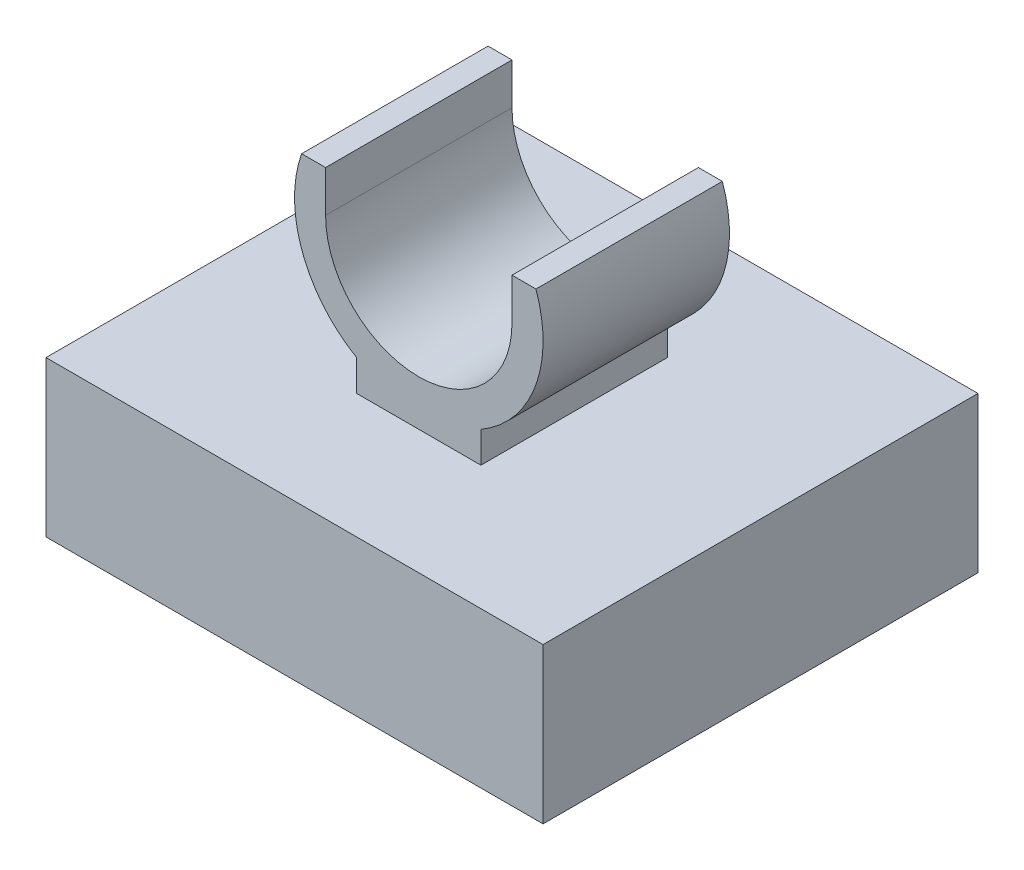
ISO-10303-21;
HEADER;
FILE_DESCRIPTION(('STEP AP214'),'2;1');
FILE_NAME('part.step','',(''),(''),'','','');
FILE_SCHEMA(('AUTOMOTIVE_DESIGN { 1 0 10303 214 1 1 1 1 }'));
ENDSEC;
DATA;
#1=APPLICATION_CONTEXT('core data for automotive mechanical design processes');
#2=APPLICATION_PROTOCOL_DEFINITION('international standard','automotive_design',2000,#1);
#3=PRODUCT_CONTEXT('',#1,'mechanical');
#4=PRODUCT('Part','Part','',(#3));
#5=PRODUCT_RELATED_PRODUCT_CATEGORY('part','',(#4));
#6=PRODUCT_DEFINITION_FORMATION('','',#4);
#7=PRODUCT_DEFINITION_CONTEXT('part definition',#1,'design');
#8=PRODUCT_DEFINITION('design','',#6,#7);
#9=PRODUCT_DEFINITION_SHAPE('','',#8);
#10=(LENGTH_UNIT() NAMED_UNIT(*) SI_UNIT(.MILLI.,.METRE.));
#11=(NAMED_UNIT(*) PLANE_ANGLE_UNIT() SI_UNIT($,.RADIAN.));
#12=(NAMED_UNIT(*) SI_UNIT($,.STERADIAN.) SOLID_ANGLE_UNIT());
#13=UNCERTAINTY_MEASURE_WITH_UNIT(LENGTH_MEASURE(1.E-05),#10,'distance_accuracy_value','');
#14=(GEOMETRIC_REPRESENTATION_CONTEXT(3) GLOBAL_UNCERTAINTY_ASSIGNED_CONTEXT((#13)) GLOBAL_UNIT_ASSIGNED_CONTEXT((#10,
#11,#12)) REPRESENTATION_CONTEXT('',''));
#15=CARTESIAN_POINT('',(0.,0.,0.));
#16=DIRECTION('',(0.,0.,1.));
#17=DIRECTION('',(1.,0.,0.));
#18=AXIS2_PLACEMENT_3D('',#15,#16,#17);
#19=CARTESIAN_POINT('',(-5.08,-3.175,4.445));
#20=DIRECTION('',(1.,0.,0.));
#21=DIRECTION('',(0.,0.,-1.));
#22=AXIS2_PLACEMENT_3D('',#19,#20,#21);
#23=PLANE('',#22);
#24=DIRECTION('',(0.,0.,-1.));
#25=VECTOR('',#24,1.);
#26=CARTESIAN_POINT('',(-5.08,-3.175,4.445));
#27=LINE('',#26,#25);
#28=CARTESIAN_POINT('',(-5.08,-3.175,4.445));
#29=VERTEX_POINT('',#28);
#30=CARTESIAN_POINT('',(-5.08,-3.175,-4.445));
#31=VERTEX_POINT('',#30);
#32=EDGE_CURVE('E12',#29,#31,#27,.T.);
#33=ORIENTED_EDGE('',*,*,#32,.F.);
#34=DIRECTION('',(0.,-1.,0.));
#35=VECTOR('',#34,1.);
#36=CARTESIAN_POINT('',(-5.08,-3.175,4.445));
#37=LINE('',#36,#35);
#38=CARTESIAN_POINT('',(-5.08,0.,4.445));
#39=VERTEX_POINT('',#38);
#40=EDGE_CURVE('E269',#39,#29,#37,.T.);
#41=ORIENTED_EDGE('',*,*,#40,.F.);
#42=DIRECTION('',(0.,0.,-1.));
#43=VECTOR('',#42,1.);
#44=CARTESIAN_POINT('',(-5.08,0.,4.445));
#45=LINE('',#44,#43);
#46=CARTESIAN_POINT('',(-5.08,0.,-4.445));
#47=VERTEX_POINT('',#46);
#48=EDGE_CURVE('E278',#39,#47,#45,.T.);
#49=ORIENTED_EDGE('',*,*,#48,.T.);
#50=DIRECTION('',(0.,-1.,0.));
#51=VECTOR('',#50,1.);
#52=CARTESIAN_POINT('',(-5.08,-3.175,-4.445));
#53=LINE('',#52,#51);
#54=EDGE_CURVE('E268',#47,#31,#53,.T.);
#55=ORIENTED_EDGE('',*,*,#54,.T.);
#56=EDGE_LOOP('',(#33,#41,#49,#55));
#57=FACE_BOUND('',#56,.T.);
#58=ADVANCED_FACE('F35',(#57),#23,.F.);
#59=CARTESIAN_POINT('',(5.08,-3.175,4.445));
#60=DIRECTION('',(0.,1.,0.));
#61=DIRECTION('',(-1.,0.,0.));
#62=AXIS2_PLACEMENT_3D('',#59,#60,#61);
#63=PLANE('',#62);
#64=DIRECTION('',(0.,0.,-1.));
#65=VECTOR('',#64,1.);
#66=CARTESIAN_POINT('',(-2.54,-3.175,2.54));
#67=LINE('',#66,#65);
#68=CARTESIAN_POINT('',(-2.54,-3.175,2.54));
#69=VERTEX_POINT('',#68);
#70=CARTESIAN_POINT('',(-2.54,-3.175,-2.54));
#71=VERTEX_POINT('',#70);
#72=EDGE_CURVE('E189',#69,#71,#67,.T.);
#73=ORIENTED_EDGE('',*,*,#72,.F.);
#74=DIRECTION('',(-1.,0.,0.));
#75=VECTOR('',#74,1.);
#76=CARTESIAN_POINT('',(2.54,-3.175,2.54));
#77=LINE('',#76,#75);
#78=CARTESIAN_POINT('',(2.54,-3.175,2.54));
#79=VERTEX_POINT('',#78);
#80=EDGE_CURVE('E49',#79,#69,#77,.T.);
#81=ORIENTED_EDGE('',*,*,#80,.F.);
#82=DIRECTION('',(0.,0.,1.));
#83=VECTOR('',#82,1.);
#84=CARTESIAN_POINT('',(2.54,-3.175,-2.54));
#85=LINE('',#84,#83);
#86=CARTESIAN_POINT('',(2.54,-3.175,-2.54));
#87=VERTEX_POINT('',#86);
#88=EDGE_CURVE('E180',#87,#79,#85,.T.);
#89=ORIENTED_EDGE('',*,*,#88,.F.);
#90=DIRECTION('',(1.,0.,0.));
#91=VECTOR('',#90,1.);
#92=CARTESIAN_POINT('',(-2.54,-3.175,-2.54));
#93=LINE('',#92,#91);
#94=EDGE_CURVE('E183',#71,#87,#93,.T.);
#95=ORIENTED_EDGE('',*,*,#94,.F.);
#96=EDGE_LOOP('',(#73,#81,#89,#95));
#97=FACE_BOUND('',#96,.T.);
#98=DIRECTION('',(1.,0.,0.));
#99=VECTOR('',#98,1.);
#100=CARTESIAN_POINT('',(5.08,-3.175,-4.445));
#101=LINE('',#100,#99);
#102=CARTESIAN_POINT('',(5.08,-3.175,-4.445));
#103=VERTEX_POINT('',#102);
#104=EDGE_CURVE('E280',#31,#103,#101,.T.);
#105=ORIENTED_EDGE('',*,*,#104,.T.);
#106=DIRECTION('',(0.,0.,-1.));
#107=VECTOR('',#106,1.);
#108=CARTESIAN_POINT('',(5.08,-3.175,4.445));
#109=LINE('',#108,#107);
#110=CARTESIAN_POINT('',(5.08,-3.175,4.445));
#111=VERTEX_POINT('',#110);
#112=EDGE_CURVE('E42',#111,#103,#109,.T.);
#113=ORIENTED_EDGE('',*,*,#112,.F.);
#114=DIRECTION('',(1.,0.,0.));
#115=VECTOR('',#114,1.);
#116=CARTESIAN_POINT('',(5.08,-3.175,4.445));
#117=LINE('',#116,#115);
#118=EDGE_CURVE('E271',#29,#111,#117,.T.);
#119=ORIENTED_EDGE('',*,*,#118,.F.);
#120=ORIENTED_EDGE('',*,*,#32,.T.);
#121=EDGE_LOOP('',(#105,#113,#119,#120));
#122=FACE_BOUND('',#121,.T.);
#123=ADVANCED_FACE('F312',(#97,#122),#63,.F.);
#124=CARTESIAN_POINT('',(5.08,0.,4.445));
#125=DIRECTION('',(-1.,0.,0.));
#126=DIRECTION('',(0.,0.,1.));
#127=AXIS2_PLACEMENT_3D('',#124,#125,#126);
#128=PLANE('',#127);
#129=DIRECTION('',(0.,1.,0.));
#130=VECTOR('',#129,1.);
#131=CARTESIAN_POINT('',(5.08,0.,-4.445));
#132=LINE('',#131,#130);
#133=CARTESIAN_POINT('',(5.08,0.,-4.445));
#134=VERTEX_POINT('',#133);
#135=EDGE_CURVE('E282',#103,#134,#132,.T.);
#136=ORIENTED_EDGE('',*,*,#135,.T.);
#137=DIRECTION('',(0.,0.,-1.));
#138=VECTOR('',#137,1.);
#139=CARTESIAN_POINT('',(5.08,0.,4.445));
#140=LINE('',#139,#138);
#141=CARTESIAN_POINT('',(5.08,0.,4.445));
#142=VERTEX_POINT('',#141);
#143=EDGE_CURVE('E287',#142,#134,#140,.T.);
#144=ORIENTED_EDGE('',*,*,#143,.F.);
#145=DIRECTION('',(0.,1.,0.));
#146=VECTOR('',#145,1.);
#147=CARTESIAN_POINT('',(5.08,0.,4.445));
#148=LINE('',#147,#146);
#149=EDGE_CURVE('E274',#111,#142,#148,.T.);
#150=ORIENTED_EDGE('',*,*,#149,.F.);
#151=ORIENTED_EDGE('',*,*,#112,.T.);
#152=EDGE_LOOP('',(#136,#144,#150,#151));
#153=FACE_BOUND('',#152,.T.);
#154=ADVANCED_FACE('F294',(#153),#128,.F.);
#155=CARTESIAN_POINT('',(-5.08,0.,4.445));
#156=DIRECTION('',(0.,-1.,0.));
#157=DIRECTION('',(0.,0.,-1.));
#158=AXIS2_PLACEMENT_3D('',#155,#156,#157);
#159=PLANE('',#158);
#160=DIRECTION('',(0.,0.,-1.));
#161=VECTOR('',#160,1.);
#162=CARTESIAN_POINT('',(-1.27,0.,1.905));
#163=LINE('',#162,#161);
#164=CARTESIAN_POINT('',(-1.27,0.,1.905));
#165=VERTEX_POINT('',#164);
#166=CARTESIAN_POINT('',(-1.27,0.,-1.905));
#167=VERTEX_POINT('',#166);
#168=EDGE_CURVE('E262',#165,#167,#163,.T.);
#169=ORIENTED_EDGE('',*,*,#168,.T.);
#170=DIRECTION('',(1.,0.,0.));
#171=VECTOR('',#170,1.);
#172=CARTESIAN_POINT('',(-1.27,0.,-1.905));
#173=LINE('',#172,#171);
#174=CARTESIAN_POINT('',(1.27,0.,-1.905));
#175=VERTEX_POINT('',#174);
#176=EDGE_CURVE('E57',#167,#175,#173,.T.);
#177=ORIENTED_EDGE('',*,*,#176,.T.);
#178=DIRECTION('',(0.,0.,-1.));
#179=VECTOR('',#178,1.);
#180=CARTESIAN_POINT('',(1.27,0.,1.905));
#181=LINE('',#180,#179);
#182=CARTESIAN_POINT('',(1.27,0.,1.905));
#183=VERTEX_POINT('',#182);
#184=EDGE_CURVE('E260',#183,#175,#181,.T.);
#185=ORIENTED_EDGE('',*,*,#184,.F.);
#186=DIRECTION('',(1.,0.,0.));
#187=VECTOR('',#186,1.);
#188=CARTESIAN_POINT('',(-1.27,0.,1.905));
#189=LINE('',#188,#187);
#190=EDGE_CURVE('E205',#165,#183,#189,.T.);
#191=ORIENTED_EDGE('',*,*,#190,.F.);
#192=EDGE_LOOP('',(#169,#177,#185,#191));
#193=FACE_BOUND('',#192,.T.);
#194=DIRECTION('',(-1.,0.,0.));
#195=VECTOR('',#194,1.);
#196=CARTESIAN_POINT('',(-5.08,0.,-4.445));
#197=LINE('',#196,#195);
#198=EDGE_CURVE('E272',#134,#47,#197,.T.);
#199=ORIENTED_EDGE('',*,*,#198,.T.);
#200=ORIENTED_EDGE('',*,*,#48,.F.);
#201=DIRECTION('',(-1.,0.,0.));
#202=VECTOR('',#201,1.);
#203=CARTESIAN_POINT('',(-5.08,0.,4.445));
#204=LINE('',#203,#202);
#205=EDGE_CURVE('E276',#142,#39,#204,.T.);
#206=ORIENTED_EDGE('',*,*,#205,.F.);
#207=ORIENTED_EDGE('',*,*,#143,.T.);
#208=EDGE_LOOP('',(#199,#200,#206,#207));
#209=FACE_BOUND('',#208,.T.);
#210=ADVANCED_FACE('F305',(#193,#209),#159,.F.);
#211=CARTESIAN_POINT('',(0.,0.,4.445));
#212=DIRECTION('',(0.,0.,-1.));
#213=DIRECTION('',(-1.,0.,0.));
#214=AXIS2_PLACEMENT_3D('',#211,#212,#213);
#215=PLANE('',#214);
#216=ORIENTED_EDGE('',*,*,#149,.T.);
#217=ORIENTED_EDGE('',*,*,#205,.T.);
#218=ORIENTED_EDGE('',*,*,#40,.T.);
#219=ORIENTED_EDGE('',*,*,#118,.T.);
#220=EDGE_LOOP('',(#216,#217,#218,#219));
#221=FACE_BOUND('',#220,.T.);
#222=ADVANCED_FACE('F311',(#221),#215,.F.);
#223=CARTESIAN_POINT('',(0.,0.,-4.445));
#224=DIRECTION('',(0.,0.,-1.));
#225=DIRECTION('',(-1.,0.,0.));
#226=AXIS2_PLACEMENT_3D('',#223,#224,#225);
#227=PLANE('',#226);
#228=ORIENTED_EDGE('',*,*,#104,.F.);
#229=ORIENTED_EDGE('',*,*,#54,.F.);
#230=ORIENTED_EDGE('',*,*,#198,.F.);
#231=ORIENTED_EDGE('',*,*,#135,.F.);
#232=EDGE_LOOP('',(#228,#229,#230,#231));
#233=FACE_BOUND('',#232,.T.);
#234=ADVANCED_FACE('F301',(#233),#227,.T.);
#235=CARTESIAN_POINT('',(0.,2.83470452561247,1.905));
#236=DIRECTION('',(0.,0.,-1.));
#237=DIRECTION('',(-1.,0.,0.));
#238=AXIS2_PLACEMENT_3D('',#235,#236,#237);
#239=CYLINDRICAL_SURFACE('',#238,2.54);
#240=CARTESIAN_POINT('',(0.,2.83470452561247,-1.905));
#241=DIRECTION('',(0.,0.,1.));
#242=DIRECTION('',(1.,0.,0.));
#243=AXIS2_PLACEMENT_3D('',#240,#241,#242);
#244=CIRCLE('',#243,2.54);
#245=CARTESIAN_POINT('',(-2.39473496561844,3.68137119227914,-1.905));
#246=VERTEX_POINT('',#245);
#247=CARTESIAN_POINT('',(-1.27,0.635,-1.905));
#248=VERTEX_POINT('',#247);
#249=EDGE_CURVE('E195',#246,#248,#244,.T.);
#250=ORIENTED_EDGE('',*,*,#249,.T.);
#251=DIRECTION('',(0.,0.,-1.));
#252=VECTOR('',#251,1.);
#253=CARTESIAN_POINT('',(-1.27,0.635,1.905));
#254=LINE('',#253,#252);
#255=CARTESIAN_POINT('',(-1.27,0.635,1.905));
#256=VERTEX_POINT('',#255);
#257=EDGE_CURVE('E265',#256,#248,#254,.T.);
#258=ORIENTED_EDGE('',*,*,#257,.F.);
#259=CARTESIAN_POINT('',(0.,2.83470452561247,1.905));
#260=DIRECTION('',(0.,0.,1.));
#261=DIRECTION('',(1.,0.,0.));
#262=AXIS2_PLACEMENT_3D('',#259,#260,#261);
#263=CIRCLE('',#262,2.54);
#264=CARTESIAN_POINT('',(-2.39473496561844,3.68137119227914,1.905));
#265=VERTEX_POINT('',#264);
#266=EDGE_CURVE('E199',#265,#256,#263,.T.);
#267=ORIENTED_EDGE('',*,*,#266,.F.);
#268=DIRECTION('',(0.,0.,-1.));
#269=VECTOR('',#268,1.);
#270=CARTESIAN_POINT('',(-2.39473496561844,3.68137119227914,1.905));
#271=LINE('',#270,#269);
#272=EDGE_CURVE('E221',#265,#246,#271,.T.);
#273=ORIENTED_EDGE('',*,*,#272,.T.);
#274=EDGE_LOOP('',(#250,#258,#267,#273));
#275=FACE_BOUND('',#274,.T.);
#276=ADVANCED_FACE('F326',(#275),#239,.T.);
#277=CARTESIAN_POINT('',(-1.27,0.635,1.905));
#278=DIRECTION('',(1.,0.,0.));
#279=DIRECTION('',(0.,1.,0.));
#280=AXIS2_PLACEMENT_3D('',#277,#278,#279);
#281=PLANE('',#280);
#282=DIRECTION('',(0.,-1.,0.));
#283=VECTOR('',#282,1.);
#284=CARTESIAN_POINT('',(-1.27,0.635,-1.905));
#285=LINE('',#284,#283);
#286=EDGE_CURVE('E224',#248,#167,#285,.T.);
#287=ORIENTED_EDGE('',*,*,#286,.T.);
#288=ORIENTED_EDGE('',*,*,#168,.F.);
#289=DIRECTION('',(0.,-1.,0.));
#290=VECTOR('',#289,1.);
#291=CARTESIAN_POINT('',(-1.27,0.635,1.905));
#292=LINE('',#291,#290);
#293=EDGE_CURVE('E202',#256,#165,#292,.T.);
#294=ORIENTED_EDGE('',*,*,#293,.F.);
#295=ORIENTED_EDGE('',*,*,#257,.T.);
#296=EDGE_LOOP('',(#287,#288,#294,#295));
#297=FACE_BOUND('',#296,.T.);
#298=ADVANCED_FACE('F331',(#297),#281,.F.);
#299=CARTESIAN_POINT('',(1.27,0.635,1.905));
#300=DIRECTION('',(-1.,0.,0.));
#301=DIRECTION('',(0.,-1.,0.));
#302=AXIS2_PLACEMENT_3D('',#299,#300,#301);
#303=PLANE('',#302);
#304=DIRECTION('',(0.,1.,0.));
#305=VECTOR('',#304,1.);
#306=CARTESIAN_POINT('',(1.27,0.635,-1.905));
#307=LINE('',#306,#305);
#308=CARTESIAN_POINT('',(1.27,0.635,-1.905));
#309=VERTEX_POINT('',#308);
#310=EDGE_CURVE('E227',#175,#309,#307,.T.);
#311=ORIENTED_EDGE('',*,*,#310,.T.);
#312=DIRECTION('',(0.,0.,-1.));
#313=VECTOR('',#312,1.);
#314=CARTESIAN_POINT('',(1.27,0.635,1.905));
#315=LINE('',#314,#313);
#316=CARTESIAN_POINT('',(1.27,0.635,1.905));
#317=VERTEX_POINT('',#316);
#318=EDGE_CURVE('E257',#317,#309,#315,.T.);
#319=ORIENTED_EDGE('',*,*,#318,.F.);
#320=DIRECTION('',(0.,1.,0.));
#321=VECTOR('',#320,1.);
#322=CARTESIAN_POINT('',(1.27,0.635,1.905));
#323=LINE('',#322,#321);
#324=EDGE_CURVE('E207',#183,#317,#323,.T.);
#325=ORIENTED_EDGE('',*,*,#324,.F.);
#326=ORIENTED_EDGE('',*,*,#184,.T.);
#327=EDGE_LOOP('',(#311,#319,#325,#326));
#328=FACE_BOUND('',#327,.T.);
#329=ADVANCED_FACE('F335',(#328),#303,.F.);
#330=CARTESIAN_POINT('',(0.,2.83470452561247,1.905));
#331=DIRECTION('',(0.,0.,-1.));
#332=DIRECTION('',(-1.,0.,0.));
#333=AXIS2_PLACEMENT_3D('',#330,#331,#332);
#334=CYLINDRICAL_SURFACE('',#333,2.54);
#335=CARTESIAN_POINT('',(0.,2.83470452561247,-1.905));
#336=DIRECTION('',(0.,0.,1.));
#337=DIRECTION('',(1.,0.,0.));
#338=AXIS2_PLACEMENT_3D('',#335,#336,#337);
#339=CIRCLE('',#338,2.54);
#340=CARTESIAN_POINT('',(2.39473496561844,3.68137119227914,-1.905));
#341=VERTEX_POINT('',#340);
#342=EDGE_CURVE('E229',#309,#341,#339,.T.);
#343=ORIENTED_EDGE('',*,*,#342,.T.);
#344=DIRECTION('',(0.,0.,-1.));
#345=VECTOR('',#344,1.);
#346=CARTESIAN_POINT('',(2.39473496561844,3.68137119227914,1.905));
#347=LINE('',#346,#345);
#348=CARTESIAN_POINT('',(2.39473496561844,3.68137119227914,1.905));
#349=VERTEX_POINT('',#348);
#350=EDGE_CURVE('E254',#349,#341,#347,.T.);
#351=ORIENTED_EDGE('',*,*,#350,.F.);
#352=CARTESIAN_POINT('',(0.,2.83470452561247,1.905));
#353=DIRECTION('',(0.,0.,1.));
#354=DIRECTION('',(1.,0.,0.));
#355=AXIS2_PLACEMENT_3D('',#352,#353,#354);
#356=CIRCLE('',#355,2.54);
#357=EDGE_CURVE('E209',#317,#349,#356,.T.);
#358=ORIENTED_EDGE('',*,*,#357,.F.);
#359=ORIENTED_EDGE('',*,*,#318,.T.);
#360=EDGE_LOOP('',(#343,#351,#358,#359));
#361=FACE_BOUND('',#360,.T.);
#362=ADVANCED_FACE('F339',(#361),#334,.T.);
#363=CARTESIAN_POINT('',(1.905,3.68137119227914,1.905));
#364=DIRECTION('',(0.,-1.,0.));
#365=DIRECTION('',(0.,0.,-1.));
#366=AXIS2_PLACEMENT_3D('',#363,#364,#365);
#367=PLANE('',#366);
#368=DIRECTION('',(-1.,0.,0.));
#369=VECTOR('',#368,1.);
#370=CARTESIAN_POINT('',(1.905,3.68137119227914,-1.905));
#371=LINE('',#370,#369);
#372=CARTESIAN_POINT('',(1.905,3.68137119227914,-1.905));
#373=VERTEX_POINT('',#372);
#374=EDGE_CURVE('E231',#341,#373,#371,.T.);
#375=ORIENTED_EDGE('',*,*,#374,.T.);
#376=DIRECTION('',(0.,0.,-1.));
#377=VECTOR('',#376,1.);
#378=CARTESIAN_POINT('',(1.905,3.68137119227914,1.905));
#379=LINE('',#378,#377);
#380=CARTESIAN_POINT('',(1.905,3.68137119227914,1.905));
#381=VERTEX_POINT('',#380);
#382=EDGE_CURVE('E251',#381,#373,#379,.T.);
#383=ORIENTED_EDGE('',*,*,#382,.F.);
#384=DIRECTION('',(-1.,0.,0.));
#385=VECTOR('',#384,1.);
#386=CARTESIAN_POINT('',(1.905,3.68137119227914,1.905));
#387=LINE('',#386,#385);
#388=EDGE_CURVE('E211',#349,#381,#387,.T.);
#389=ORIENTED_EDGE('',*,*,#388,.F.);
#390=ORIENTED_EDGE('',*,*,#350,.T.);
#391=EDGE_LOOP('',(#375,#383,#389,#390));
#392=FACE_BOUND('',#391,.T.);
#393=ADVANCED_FACE('F343',(#392),#367,.F.);
#394=CARTESIAN_POINT('',(1.905,2.83470452561247,1.905));
#395=DIRECTION('',(1.,0.,0.));
#396=DIRECTION('',(0.,0.,-1.));
#397=AXIS2_PLACEMENT_3D('',#394,#395,#396);
#398=PLANE('',#397);
#399=DIRECTION('',(0.,-1.,0.));
#400=VECTOR('',#399,1.);
#401=CARTESIAN_POINT('',(1.905,2.83470452561247,-1.905));
#402=LINE('',#401,#400);
#403=CARTESIAN_POINT('',(1.905,2.83470452561247,-1.905));
#404=VERTEX_POINT('',#403);
#405=EDGE_CURVE('E233',#373,#404,#402,.T.);
#406=ORIENTED_EDGE('',*,*,#405,.T.);
#407=DIRECTION('',(0.,0.,-1.));
#408=VECTOR('',#407,1.);
#409=CARTESIAN_POINT('',(1.905,2.83470452561247,1.905));
#410=LINE('',#409,#408);
#411=CARTESIAN_POINT('',(1.905,2.83470452561247,1.905));
#412=VERTEX_POINT('',#411);
#413=EDGE_CURVE('E248',#412,#404,#410,.T.);
#414=ORIENTED_EDGE('',*,*,#413,.F.);
#415=DIRECTION('',(0.,-1.,0.));
#416=VECTOR('',#415,1.);
#417=CARTESIAN_POINT('',(1.905,2.83470452561247,1.905));
#418=LINE('',#417,#416);
#419=EDGE_CURVE('E213',#381,#412,#418,.T.);
#420=ORIENTED_EDGE('',*,*,#419,.F.);
#421=ORIENTED_EDGE('',*,*,#382,.T.);
#422=EDGE_LOOP('',(#406,#414,#420,#421));
#423=FACE_BOUND('',#422,.T.);
#424=ADVANCED_FACE('F347',(#423),#398,.F.);
#425=CARTESIAN_POINT('',(0.,2.83470452561247,1.905));
#426=DIRECTION('',(0.,0.,-1.));
#427=DIRECTION('',(-1.,0.,0.));
#428=AXIS2_PLACEMENT_3D('',#425,#426,#427);
#429=CYLINDRICAL_SURFACE('',#428,1.905);
#430=CARTESIAN_POINT('',(0.,2.83470452561247,-1.905));
#431=DIRECTION('',(0.,0.,-1.));
#432=DIRECTION('',(1.,0.,0.));
#433=AXIS2_PLACEMENT_3D('',#430,#431,#432);
#434=CIRCLE('',#433,1.905);
#435=CARTESIAN_POINT('',(-1.905,2.83470452561247,-1.905));
#436=VERTEX_POINT('',#435);
#437=EDGE_CURVE('E235',#404,#436,#434,.T.);
#438=ORIENTED_EDGE('',*,*,#437,.T.);
#439=DIRECTION('',(0.,0.,-1.));
#440=VECTOR('',#439,1.);
#441=CARTESIAN_POINT('',(-1.905,2.83470452561247,1.905));
#442=LINE('',#441,#440);
#443=CARTESIAN_POINT('',(-1.905,2.83470452561247,1.905));
#444=VERTEX_POINT('',#443);
#445=EDGE_CURVE('E245',#444,#436,#442,.T.);
#446=ORIENTED_EDGE('',*,*,#445,.F.);
#447=CARTESIAN_POINT('',(0.,2.83470452561247,1.905));
#448=DIRECTION('',(0.,0.,-1.));
#449=DIRECTION('',(1.,0.,0.));
#450=AXIS2_PLACEMENT_3D('',#447,#448,#449);
#451=CIRCLE('',#450,1.905);
#452=EDGE_CURVE('E215',#412,#444,#451,.T.);
#453=ORIENTED_EDGE('',*,*,#452,.F.);
#454=ORIENTED_EDGE('',*,*,#413,.T.);
#455=EDGE_LOOP('',(#438,#446,#453,#454));
#456=FACE_BOUND('',#455,.T.);
#457=ADVANCED_FACE('F351',(#456),#429,.F.);
#458=CARTESIAN_POINT('',(-1.905,2.83470452561247,1.905));
#459=DIRECTION('',(-1.,0.,0.));
#460=DIRECTION('',(0.,0.,1.));
#461=AXIS2_PLACEMENT_3D('',#458,#459,#460);
#462=PLANE('',#461);
#463=DIRECTION('',(0.,1.,0.));
#464=VECTOR('',#463,1.);
#465=CARTESIAN_POINT('',(-1.905,2.83470452561247,-1.905));
#466=LINE('',#465,#464);
#467=CARTESIAN_POINT('',(-1.905,3.68137119227914,-1.905));
#468=VERTEX_POINT('',#467);
#469=EDGE_CURVE('E237',#436,#468,#466,.T.);
#470=ORIENTED_EDGE('',*,*,#469,.T.);
#471=DIRECTION('',(0.,0.,-1.));
#472=VECTOR('',#471,1.);
#473=CARTESIAN_POINT('',(-1.905,3.68137119227914,1.905));
#474=LINE('',#473,#472);
#475=CARTESIAN_POINT('',(-1.905,3.68137119227914,1.905));
#476=VERTEX_POINT('',#475);
#477=EDGE_CURVE('E242',#476,#468,#474,.T.);
#478=ORIENTED_EDGE('',*,*,#477,.F.);
#479=DIRECTION('',(0.,1.,0.));
#480=VECTOR('',#479,1.);
#481=CARTESIAN_POINT('',(-1.905,2.83470452561247,1.905));
#482=LINE('',#481,#480);
#483=EDGE_CURVE('E217',#444,#476,#482,.T.);
#484=ORIENTED_EDGE('',*,*,#483,.F.);
#485=ORIENTED_EDGE('',*,*,#445,.T.);
#486=EDGE_LOOP('',(#470,#478,#484,#485));
#487=FACE_BOUND('',#486,.T.);
#488=ADVANCED_FACE('F355',(#487),#462,.F.);
#489=CARTESIAN_POINT('',(-2.39473496561844,3.68137119227914,1.905));
#490=DIRECTION('',(0.,-1.,0.));
#491=DIRECTION('',(0.,0.,-1.));
#492=AXIS2_PLACEMENT_3D('',#489,#490,#491);
#493=PLANE('',#492);
#494=DIRECTION('',(-1.,0.,0.));
#495=VECTOR('',#494,1.);
#496=CARTESIAN_POINT('',(-2.39473496561844,3.68137119227914,-1.905));
#497=LINE('',#496,#495);
#498=EDGE_CURVE('E203',#468,#246,#497,.T.);
#499=ORIENTED_EDGE('',*,*,#498,.T.);
#500=ORIENTED_EDGE('',*,*,#272,.F.);
#501=DIRECTION('',(-1.,0.,0.));
#502=VECTOR('',#501,1.);
#503=CARTESIAN_POINT('',(-2.39473496561844,3.68137119227914,1.905));
#504=LINE('',#503,#502);
#505=EDGE_CURVE('E219',#476,#265,#504,.T.);
#506=ORIENTED_EDGE('',*,*,#505,.F.);
#507=ORIENTED_EDGE('',*,*,#477,.T.);
#508=EDGE_LOOP('',(#499,#500,#506,#507));
#509=FACE_BOUND('',#508,.T.);
#510=ADVANCED_FACE('F359',(#509),#493,.F.);
#511=CARTESIAN_POINT('',(0.,2.83470452561247,1.905));
#512=DIRECTION('',(0.,0.,1.));
#513=DIRECTION('',(1.,0.,0.));
#514=AXIS2_PLACEMENT_3D('',#511,#512,#513);
#515=PLANE('',#514);
#516=ORIENTED_EDGE('',*,*,#266,.T.);
#517=ORIENTED_EDGE('',*,*,#293,.T.);
#518=ORIENTED_EDGE('',*,*,#190,.T.);
#519=ORIENTED_EDGE('',*,*,#324,.T.);
#520=ORIENTED_EDGE('',*,*,#357,.T.);
#521=ORIENTED_EDGE('',*,*,#388,.T.);
#522=ORIENTED_EDGE('',*,*,#419,.T.);
#523=ORIENTED_EDGE('',*,*,#452,.T.);
#524=ORIENTED_EDGE('',*,*,#483,.T.);
#525=ORIENTED_EDGE('',*,*,#505,.T.);
#526=EDGE_LOOP('',(#516,#517,#518,#519,#520,#521,#522,#523,#524,#525));
#527=FACE_BOUND('',#526,.T.);
#528=ADVANCED_FACE('F363',(#527),#515,.T.);
#529=CARTESIAN_POINT('',(0.,2.83470452561247,-1.905));
#530=DIRECTION('',(0.,0.,1.));
#531=DIRECTION('',(1.,0.,0.));
#532=AXIS2_PLACEMENT_3D('',#529,#530,#531);
#533=PLANE('',#532);
#534=ORIENTED_EDGE('',*,*,#249,.F.);
#535=ORIENTED_EDGE('',*,*,#498,.F.);
#536=ORIENTED_EDGE('',*,*,#469,.F.);
#537=ORIENTED_EDGE('',*,*,#437,.F.);
#538=ORIENTED_EDGE('',*,*,#405,.F.);
#539=ORIENTED_EDGE('',*,*,#374,.F.);
#540=ORIENTED_EDGE('',*,*,#342,.F.);
#541=ORIENTED_EDGE('',*,*,#310,.F.);
#542=ORIENTED_EDGE('',*,*,#176,.F.);
#543=ORIENTED_EDGE('',*,*,#286,.F.);
#544=EDGE_LOOP('',(#534,#535,#536,#537,#538,#539,#540,#541,#542,#543));
#545=FACE_BOUND('',#544,.T.);
#546=ADVANCED_FACE('F365',(#545),#533,.F.);
#547=CARTESIAN_POINT('',(2.54,-1.27,2.54));
#548=DIRECTION('',(0.,0.,1.));
#549=DIRECTION('',(1.,0.,0.));
#550=AXIS2_PLACEMENT_3D('',#547,#548,#549);
#551=PLANE('',#550);
#552=ORIENTED_EDGE('',*,*,#80,.T.);
#553=DIRECTION('',(0.,-1.,0.));
#554=VECTOR('',#553,1.);
#555=CARTESIAN_POINT('',(-2.54,-1.27,2.54));
#556=LINE('',#555,#554);
#557=CARTESIAN_POINT('',(-2.54,-1.27,2.54));
#558=VERTEX_POINT('',#557);
#559=EDGE_CURVE('E158',#558,#69,#556,.T.);
#560=ORIENTED_EDGE('',*,*,#559,.F.);
#561=DIRECTION('',(-1.,0.,0.));
#562=VECTOR('',#561,1.);
#563=CARTESIAN_POINT('',(2.54,-1.27,2.54));
#564=LINE('',#563,#562);
#565=CARTESIAN_POINT('',(2.54,-1.27,2.54));
#566=VERTEX_POINT('',#565);
#567=EDGE_CURVE('E162',#566,#558,#564,.T.);
#568=ORIENTED_EDGE('',*,*,#567,.F.);
#569=DIRECTION('',(0.,-1.,0.));
#570=VECTOR('',#569,1.);
#571=CARTESIAN_POINT('',(2.54,-1.27,2.54));
#572=LINE('',#571,#570);
#573=EDGE_CURVE('E193',#566,#79,#572,.T.);
#574=ORIENTED_EDGE('',*,*,#573,.T.);
#575=EDGE_LOOP('',(#552,#560,#568,#574));
#576=FACE_BOUND('',#575,.T.);
#577=ADVANCED_FACE('F160',(#576),#551,.F.);
#578=CARTESIAN_POINT('',(2.54,-1.27,-2.54));
#579=DIRECTION('',(1.,0.,0.));
#580=DIRECTION('',(0.,1.,0.));
#581=AXIS2_PLACEMENT_3D('',#578,#579,#580);
#582=PLANE('',#581);
#583=ORIENTED_EDGE('',*,*,#88,.T.);
#584=ORIENTED_EDGE('',*,*,#573,.F.);
#585=DIRECTION('',(0.,0.,1.));
#586=VECTOR('',#585,1.);
#587=CARTESIAN_POINT('',(2.54,-1.27,-2.54));
#588=LINE('',#587,#586);
#589=CARTESIAN_POINT('',(2.54,-1.27,-2.54));
#590=VERTEX_POINT('',#589);
#591=EDGE_CURVE('E168',#590,#566,#588,.T.);
#592=ORIENTED_EDGE('',*,*,#591,.F.);
#593=DIRECTION('',(0.,-1.,0.));
#594=VECTOR('',#593,1.);
#595=CARTESIAN_POINT('',(2.54,-1.27,-2.54));
#596=LINE('',#595,#594);
#597=EDGE_CURVE('E196',#590,#87,#596,.T.);
#598=ORIENTED_EDGE('',*,*,#597,.T.);
#599=EDGE_LOOP('',(#583,#584,#592,#598));
#600=FACE_BOUND('',#599,.T.);
#601=ADVANCED_FACE('F373',(#600),#582,.F.);
#602=CARTESIAN_POINT('',(-2.54,-1.27,-2.54));
#603=DIRECTION('',(0.,0.,-1.));
#604=DIRECTION('',(-1.,0.,0.));
#605=AXIS2_PLACEMENT_3D('',#602,#603,#604);
#606=PLANE('',#605);
#607=ORIENTED_EDGE('',*,*,#94,.T.);
#608=ORIENTED_EDGE('',*,*,#597,.F.);
#609=DIRECTION('',(1.,0.,0.));
#610=VECTOR('',#609,1.);
#611=CARTESIAN_POINT('',(-2.54,-1.27,-2.54));
#612=LINE('',#611,#610);
#613=CARTESIAN_POINT('',(-2.54,-1.27,-2.54));
#614=VERTEX_POINT('',#613);
#615=EDGE_CURVE('E176',#614,#590,#612,.T.);
#616=ORIENTED_EDGE('',*,*,#615,.F.);
#617=DIRECTION('',(0.,-1.,0.));
#618=VECTOR('',#617,1.);
#619=CARTESIAN_POINT('',(-2.54,-1.27,-2.54));
#620=LINE('',#619,#618);
#621=EDGE_CURVE('E167',#614,#71,#620,.T.);
#622=ORIENTED_EDGE('',*,*,#621,.T.);
#623=EDGE_LOOP('',(#607,#608,#616,#622));
#624=FACE_BOUND('',#623,.T.);
#625=ADVANCED_FACE('F376',(#624),#606,.F.);
#626=CARTESIAN_POINT('',(-2.54,-1.27,2.54));
#627=DIRECTION('',(-1.,0.,0.));
#628=DIRECTION('',(0.,-1.,0.));
#629=AXIS2_PLACEMENT_3D('',#626,#627,#628);
#630=PLANE('',#629);
#631=ORIENTED_EDGE('',*,*,#72,.T.);
#632=ORIENTED_EDGE('',*,*,#621,.F.);
#633=DIRECTION('',(0.,0.,-1.));
#634=VECTOR('',#633,1.);
#635=CARTESIAN_POINT('',(-2.54,-1.27,2.54));
#636=LINE('',#635,#634);
#637=EDGE_CURVE('E171',#558,#614,#636,.T.);
#638=ORIENTED_EDGE('',*,*,#637,.F.);
#639=ORIENTED_EDGE('',*,*,#559,.T.);
#640=EDGE_LOOP('',(#631,#632,#638,#639));
#641=FACE_BOUND('',#640,.T.);
#642=ADVANCED_FACE('F172',(#641),#630,.F.);
#643=CARTESIAN_POINT('',(0.,-1.27,0.));
#644=DIRECTION('',(0.,-1.,0.));
#645=DIRECTION('',(1.,0.,0.));
#646=AXIS2_PLACEMENT_3D('',#643,#644,#645);
#647=PLANE('',#646);
#648=ORIENTED_EDGE('',*,*,#567,.T.);
#649=ORIENTED_EDGE('',*,*,#637,.T.);
#650=ORIENTED_EDGE('',*,*,#615,.T.);
#651=ORIENTED_EDGE('',*,*,#591,.T.);
#652=EDGE_LOOP('',(#648,#649,#650,#651));
#653=FACE_BOUND('',#652,.T.);
#654=ADVANCED_FACE('F178',(#653),#647,.T.);
#655=CLOSED_SHELL('',(#58,#123,#154,#210,#222,#234,#276,#298,#329,#362,#393,#424,#457,#488,#510,
#528,#546,#577,#601,#625,#642,#654));
#656=MANIFOLD_SOLID_BREP('B2',#655);
#657=ADVANCED_BREP_SHAPE_REPRESENTATION('',(#18,#656),#14);
#658=SHAPE_DEFINITION_REPRESENTATION(#9,#657);
ENDSEC;
END-ISO-10303-21;
